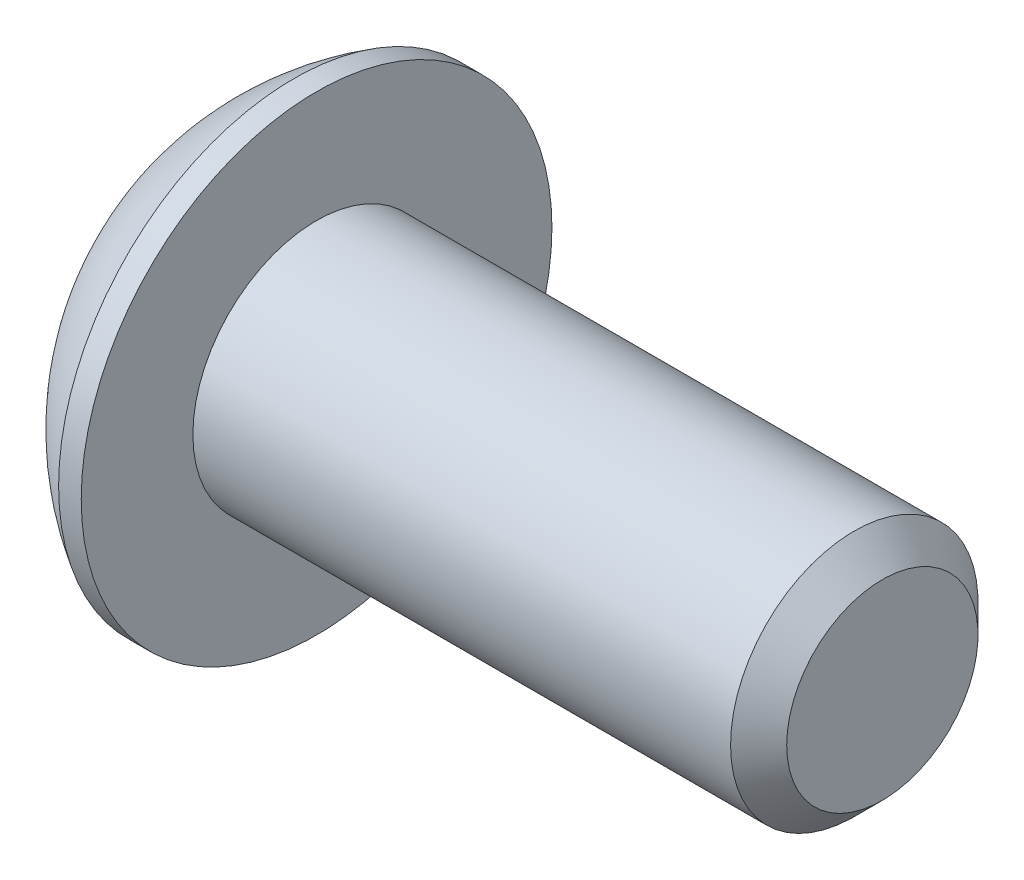
ISO-10303-21;
HEADER;
FILE_DESCRIPTION(('STEP AP214'),'2;1');
FILE_NAME('part.step','',(''),(''),'','','');
FILE_SCHEMA(('AUTOMOTIVE_DESIGN { 1 0 10303 214 1 1 1 1 }'));
ENDSEC;
DATA;
#1=APPLICATION_CONTEXT('core data for automotive mechanical design processes');
#2=APPLICATION_PROTOCOL_DEFINITION('international standard','automotive_design',2000,#1);
#3=PRODUCT_CONTEXT('',#1,'mechanical');
#4=PRODUCT('Part','Part','',(#3));
#5=PRODUCT_RELATED_PRODUCT_CATEGORY('part','',(#4));
#6=PRODUCT_DEFINITION_FORMATION('','',#4);
#7=PRODUCT_DEFINITION_CONTEXT('part definition',#1,'design');
#8=PRODUCT_DEFINITION('design','',#6,#7);
#9=PRODUCT_DEFINITION_SHAPE('','',#8);
#10=(LENGTH_UNIT() NAMED_UNIT(*) SI_UNIT(.MILLI.,.METRE.));
#11=(NAMED_UNIT(*) PLANE_ANGLE_UNIT() SI_UNIT($,.RADIAN.));
#12=(NAMED_UNIT(*) SI_UNIT($,.STERADIAN.) SOLID_ANGLE_UNIT());
#13=UNCERTAINTY_MEASURE_WITH_UNIT(LENGTH_MEASURE(1.E-05),#10,'distance_accuracy_value','');
#14=(GEOMETRIC_REPRESENTATION_CONTEXT(3) GLOBAL_UNCERTAINTY_ASSIGNED_CONTEXT((#13)) GLOBAL_UNIT_ASSIGNED_CONTEXT((#10,
#11,#12)) REPRESENTATION_CONTEXT('',''));
#15=CARTESIAN_POINT('',(0.,0.,0.));
#16=DIRECTION('',(0.,0.,1.));
#17=DIRECTION('',(1.,0.,0.));
#18=AXIS2_PLACEMENT_3D('',#15,#16,#17);
#19=CARTESIAN_POINT('',(1.32080000014412,0.,0.));
#20=DIRECTION('',(-1.,0.,0.));
#21=DIRECTION('',(0.,0.,1.));
#22=AXIS2_PLACEMENT_3D('',#19,#20,#21);
#23=CONICAL_SURFACE('',#22,1.1937999997258,1.04719755090695);
#24=CARTESIAN_POINT('',(2.01004075140077,0.,3.41060513164848E-10));
#25=VERTEX_POINT('',#24);
#26=VERTEX_LOOP('',#25);
#27=FACE_BOUND('',#26,.T.);
#28=CARTESIAN_POINT('',(1.32079999998002,0.,0.));
#29=DIRECTION('',(-1.,0.,0.));
#30=DIRECTION('',(0.,0.,1.));
#31=AXIS2_PLACEMENT_3D('',#28,#29,#30);
#32=CIRCLE('',#31,1.19380000001001);
#33=CARTESIAN_POINT('',(1.32079999999001,-1.03386112704374,0.596900000002159));
#34=VERTEX_POINT('',#33);
#35=CARTESIAN_POINT('',(1.32079999999762,0.,1.1937999999933));
#36=VERTEX_POINT('',#35);
#37=EDGE_CURVE('E92',#34,#36,#32,.T.);
#38=ORIENTED_EDGE('',*,*,#37,.T.);
#39=CARTESIAN_POINT('',(1.32079999998002,0.,0.));
#40=DIRECTION('',(-1.,0.,0.));
#41=DIRECTION('',(0.,0.,1.));
#42=AXIS2_PLACEMENT_3D('',#39,#40,#41);
#43=CIRCLE('',#42,1.19380000001001);
#44=CARTESIAN_POINT('',(1.32079999999001,1.0338611271453,0.596899999814944));
#45=VERTEX_POINT('',#44);
#46=EDGE_CURVE('E88',#36,#45,#43,.T.);
#47=ORIENTED_EDGE('',*,*,#46,.T.);
#48=CARTESIAN_POINT('',(1.32079999998003,0.,0.));
#49=DIRECTION('',(-1.,0.,0.));
#50=DIRECTION('',(0.,0.,1.));
#51=AXIS2_PLACEMENT_3D('',#48,#49,#50);
#52=CIRCLE('',#51,1.19380000001001);
#53=CARTESIAN_POINT('',(1.32079999999001,1.03386112693203,-0.596900000187939));
#54=VERTEX_POINT('',#53);
#55=EDGE_CURVE('E21',#45,#54,#52,.T.);
#56=ORIENTED_EDGE('',*,*,#55,.T.);
#57=CARTESIAN_POINT('',(1.32079999998002,0.,0.));
#58=DIRECTION('',(-1.,0.,0.));
#59=DIRECTION('',(0.,0.,1.));
#60=AXIS2_PLACEMENT_3D('',#57,#58,#59);
#61=CIRCLE('',#60,1.19380000001001);
#62=CARTESIAN_POINT('',(1.32079999999762,0.,-1.1937999999933));
#63=VERTEX_POINT('',#62);
#64=EDGE_CURVE('E151',#54,#63,#61,.T.);
#65=ORIENTED_EDGE('',*,*,#64,.T.);
#66=CARTESIAN_POINT('',(1.32079999998002,0.,0.));
#67=DIRECTION('',(-1.,0.,0.));
#68=DIRECTION('',(0.,0.,1.));
#69=AXIS2_PLACEMENT_3D('',#66,#67,#68);
#70=CIRCLE('',#69,1.19380000001001);
#71=CARTESIAN_POINT('',(1.32079999999001,-1.03386112704296,-0.596900000001708));
#72=VERTEX_POINT('',#71);
#73=EDGE_CURVE('E153',#63,#72,#70,.T.);
#74=ORIENTED_EDGE('',*,*,#73,.T.);
#75=CARTESIAN_POINT('',(1.32079999998002,0.,0.));
#76=DIRECTION('',(-1.,0.,0.));
#77=DIRECTION('',(0.,0.,1.));
#78=AXIS2_PLACEMENT_3D('',#75,#76,#77);
#79=CIRCLE('',#78,1.19380000001001);
#80=EDGE_CURVE('E155',#72,#34,#79,.T.);
#81=ORIENTED_EDGE('',*,*,#80,.T.);
#82=EDGE_LOOP('',(#38,#47,#56,#65,#74,#81));
#83=FACE_BOUND('',#82,.T.);
#84=ADVANCED_FACE('F17',(#27,#83),#23,.F.);
#85=CARTESIAN_POINT('',(1.3208,-2.06772225408,-1.1938));
#86=DIRECTION('',(1.,0.,0.));
#87=DIRECTION('',(0.,0.,-1.));
#88=AXIS2_PLACEMENT_3D('',#85,#86,#87);
#89=PLANE('',#88);
#90=DIRECTION('',(0.,-0.50000000000019,-0.866025403784329));
#91=VECTOR('',#90,1.);
#92=CARTESIAN_POINT('',(1.3208,1.37848150272,0.));
#93=LINE('',#92,#91);
#94=CARTESIAN_POINT('',(1.3208,1.37848150279077,-3.72749622214019E-10));
#95=VERTEX_POINT('',#94);
#96=EDGE_CURVE('E104',#54,#95,#93,.F.);
#97=ORIENTED_EDGE('',*,*,#96,.F.);
#98=ORIENTED_EDGE('',*,*,#55,.F.);
#99=DIRECTION('',(0.,0.50000000000019,-0.866025403784329));
#100=VECTOR('',#99,1.);
#101=CARTESIAN_POINT('',(1.3208,0.689240751359,1.1938));
#102=LINE('',#101,#100);
#103=EDGE_CURVE('E102',#95,#45,#102,.F.);
#104=ORIENTED_EDGE('',*,*,#103,.F.);
#105=EDGE_LOOP('',(#97,#98,#104));
#106=FACE_BOUND('',#105,.T.);
#107=ADVANCED_FACE('F100',(#106),#89,.F.);
#108=CARTESIAN_POINT('',(1.3208,-2.06772225408,-1.1938));
#109=DIRECTION('',(1.,0.,0.));
#110=DIRECTION('',(0.,0.,-1.));
#111=AXIS2_PLACEMENT_3D('',#108,#109,#110);
#112=PLANE('',#111);
#113=DIRECTION('',(0.,0.50000000000019,-0.866025403784329));
#114=VECTOR('',#113,1.);
#115=CARTESIAN_POINT('',(1.3208,0.689240751359,1.1938));
#116=LINE('',#115,#114);
#117=CARTESIAN_POINT('',(1.3208,0.689240751645,1.1938));
#118=VERTEX_POINT('',#117);
#119=EDGE_CURVE('E106',#45,#118,#116,.F.);
#120=ORIENTED_EDGE('',*,*,#119,.F.);
#121=ORIENTED_EDGE('',*,*,#46,.F.);
#122=DIRECTION('',(0.,1.,0.));
#123=VECTOR('',#122,1.);
#124=CARTESIAN_POINT('',(1.3208,-0.689240751359,1.1938));
#125=LINE('',#124,#123);
#126=EDGE_CURVE('E109',#118,#36,#125,.F.);
#127=ORIENTED_EDGE('',*,*,#126,.F.);
#128=EDGE_LOOP('',(#120,#121,#127));
#129=FACE_BOUND('',#128,.T.);
#130=ADVANCED_FACE('F107',(#129),#112,.F.);
#131=CARTESIAN_POINT('',(1.3208,-2.06772225408,-1.1938));
#132=DIRECTION('',(1.,0.,0.));
#133=DIRECTION('',(0.,0.,-1.));
#134=AXIS2_PLACEMENT_3D('',#131,#132,#133);
#135=PLANE('',#134);
#136=DIRECTION('',(0.,1.,0.));
#137=VECTOR('',#136,1.);
#138=CARTESIAN_POINT('',(1.3208,-0.689240751359,1.1938));
#139=LINE('',#138,#137);
#140=CARTESIAN_POINT('',(1.3208,-0.689240751152531,1.19380000011176));
#141=VERTEX_POINT('',#140);
#142=EDGE_CURVE('E169',#36,#141,#139,.F.);
#143=ORIENTED_EDGE('',*,*,#142,.F.);
#144=ORIENTED_EDGE('',*,*,#37,.F.);
#145=DIRECTION('',(0.,0.50000000000019,0.866025403784329));
#146=VECTOR('',#145,1.);
#147=CARTESIAN_POINT('',(1.3208,-1.37848150272,0.));
#148=LINE('',#147,#146);
#149=EDGE_CURVE('E167',#141,#34,#148,.F.);
#150=ORIENTED_EDGE('',*,*,#149,.F.);
#151=EDGE_LOOP('',(#143,#144,#150));
#152=FACE_BOUND('',#151,.T.);
#153=ADVANCED_FACE('F165',(#152),#135,.F.);
#154=CARTESIAN_POINT('',(1.3208,-2.06772225408,-1.1938));
#155=DIRECTION('',(1.,0.,0.));
#156=DIRECTION('',(0.,0.,-1.));
#157=AXIS2_PLACEMENT_3D('',#154,#155,#156);
#158=PLANE('',#157);
#159=DIRECTION('',(0.,0.50000000000019,0.866025403784329));
#160=VECTOR('',#159,1.);
#161=CARTESIAN_POINT('',(1.3208,-1.37848150272,0.));
#162=LINE('',#161,#160);
#163=CARTESIAN_POINT('',(1.3208,-1.37848150279077,3.72752211722761E-10));
#164=VERTEX_POINT('',#163);
#165=EDGE_CURVE('E170',#34,#164,#162,.F.);
#166=ORIENTED_EDGE('',*,*,#165,.F.);
#167=ORIENTED_EDGE('',*,*,#80,.F.);
#168=DIRECTION('',(0.,-0.50000000000019,0.866025403784329));
#169=VECTOR('',#168,1.);
#170=CARTESIAN_POINT('',(1.3208,-0.689240751359,-1.1938));
#171=LINE('',#170,#169);
#172=EDGE_CURVE('E173',#164,#72,#171,.F.);
#173=ORIENTED_EDGE('',*,*,#172,.F.);
#174=EDGE_LOOP('',(#166,#167,#173));
#175=FACE_BOUND('',#174,.T.);
#176=ADVANCED_FACE('F171',(#175),#158,.F.);
#177=CARTESIAN_POINT('',(1.3208,-2.06772225408,-1.1938));
#178=DIRECTION('',(1.,0.,0.));
#179=DIRECTION('',(0.,0.,-1.));
#180=AXIS2_PLACEMENT_3D('',#177,#178,#179);
#181=PLANE('',#180);
#182=DIRECTION('',(0.,-0.50000000000019,0.866025403784329));
#183=VECTOR('',#182,1.);
#184=CARTESIAN_POINT('',(1.3208,-0.689240751359,-1.1938));
#185=LINE('',#184,#183);
#186=CARTESIAN_POINT('',(1.3208,-0.6892407517165,-1.19379999987616));
#187=VERTEX_POINT('',#186);
#188=EDGE_CURVE('E229',#72,#187,#185,.F.);
#189=ORIENTED_EDGE('',*,*,#188,.F.);
#190=ORIENTED_EDGE('',*,*,#73,.F.);
#191=DIRECTION('',(0.,1.,0.));
#192=VECTOR('',#191,1.);
#193=CARTESIAN_POINT('',(1.3208,0.689240751359,-1.1938));
#194=LINE('',#193,#192);
#195=EDGE_CURVE('E241',#187,#63,#194,.T.);
#196=ORIENTED_EDGE('',*,*,#195,.F.);
#197=EDGE_LOOP('',(#189,#190,#196));
#198=FACE_BOUND('',#197,.T.);
#199=ADVANCED_FACE('F390',(#198),#181,.F.);
#200=CARTESIAN_POINT('',(1.3208,-2.06772225408,-1.1938));
#201=DIRECTION('',(1.,0.,0.));
#202=DIRECTION('',(0.,0.,-1.));
#203=AXIS2_PLACEMENT_3D('',#200,#201,#202);
#204=PLANE('',#203);
#205=DIRECTION('',(0.,1.,0.));
#206=VECTOR('',#205,1.);
#207=CARTESIAN_POINT('',(1.3208,0.689240751359,-1.1938));
#208=LINE('',#207,#206);
#209=CARTESIAN_POINT('',(1.3208,0.689240751117686,-1.19380000001943));
#210=VERTEX_POINT('',#209);
#211=EDGE_CURVE('E249',#63,#210,#208,.T.);
#212=ORIENTED_EDGE('',*,*,#211,.F.);
#213=ORIENTED_EDGE('',*,*,#64,.F.);
#214=DIRECTION('',(0.,-0.50000000000019,-0.866025403784329));
#215=VECTOR('',#214,1.);
#216=CARTESIAN_POINT('',(1.3208,1.37848150272,0.));
#217=LINE('',#216,#215);
#218=EDGE_CURVE('E128',#210,#54,#217,.F.);
#219=ORIENTED_EDGE('',*,*,#218,.F.);
#220=EDGE_LOOP('',(#212,#213,#219));
#221=FACE_BOUND('',#220,.T.);
#222=ADVANCED_FACE('F380',(#221),#204,.F.);
#223=CARTESIAN_POINT('',(1.3208,1.37848150272,0.));
#224=DIRECTION('',(0.,-0.866025403784329,0.50000000000019));
#225=DIRECTION('',(0.,-0.50000000000019,-0.866025403784329));
#226=AXIS2_PLACEMENT_3D('',#223,#224,#225);
#227=PLANE('',#226);
#228=ORIENTED_EDGE('',*,*,#96,.T.);
#229=DIRECTION('',(1.,0.,0.));
#230=VECTOR('',#229,1.);
#231=CARTESIAN_POINT('',(1.3208,1.37848150293344,-3.73289723784587E-10));
#232=LINE('',#231,#230);
#233=CARTESIAN_POINT('',(0.,1.37848150322979,-1.40005375444813E-10));
#234=VERTEX_POINT('',#233);
#235=EDGE_CURVE('E116',#234,#95,#232,.T.);
#236=ORIENTED_EDGE('',*,*,#235,.F.);
#237=DIRECTION('',(0.,0.500000000088179,0.866025403733529));
#238=VECTOR('',#237,1.);
#239=CARTESIAN_POINT('',(0.,0.689240751788,-1.19380000047));
#240=LINE('',#239,#238);
#241=CARTESIAN_POINT('',(0.,0.689240751311394,-1.19380000020132));
#242=VERTEX_POINT('',#241);
#243=EDGE_CURVE('E131',#242,#234,#240,.T.);
#244=ORIENTED_EDGE('',*,*,#243,.F.);
#245=DIRECTION('',(1.,0.,0.));
#246=VECTOR('',#245,1.);
#247=CARTESIAN_POINT('',(1.3208,0.689240750929,-1.1938));
#248=LINE('',#247,#246);
#249=EDGE_CURVE('E135',#210,#242,#248,.F.);
#250=ORIENTED_EDGE('',*,*,#249,.F.);
#251=ORIENTED_EDGE('',*,*,#218,.T.);
#252=EDGE_LOOP('',(#228,#236,#244,#250,#251));
#253=FACE_BOUND('',#252,.T.);
#254=ADVANCED_FACE('F371',(#253),#227,.T.);
#255=CARTESIAN_POINT('',(1.3208,0.689240751359,1.1938));
#256=DIRECTION('',(0.,-0.866025403784329,-0.50000000000019));
#257=DIRECTION('',(0.,0.50000000000019,-0.866025403784329));
#258=AXIS2_PLACEMENT_3D('',#255,#256,#257);
#259=PLANE('',#258);
#260=ORIENTED_EDGE('',*,*,#119,.T.);
#261=DIRECTION('',(1.,0.,0.));
#262=VECTOR('',#261,1.);
#263=CARTESIAN_POINT('',(1.3208,0.689240751788,1.1938));
#264=LINE('',#263,#262);
#265=CARTESIAN_POINT('',(0.,0.68924075168075,1.193800000235));
#266=VERTEX_POINT('',#265);
#267=EDGE_CURVE('E112',#266,#118,#264,.T.);
#268=ORIENTED_EDGE('',*,*,#267,.F.);
#269=DIRECTION('',(0.,-0.500000000088179,0.866025403733529));
#270=VECTOR('',#269,1.);
#271=CARTESIAN_POINT('',(0.,1.37848150358,0.));
#272=LINE('',#271,#270);
#273=EDGE_CURVE('E134',#234,#266,#272,.T.);
#274=ORIENTED_EDGE('',*,*,#273,.F.);
#275=ORIENTED_EDGE('',*,*,#235,.T.);
#276=ORIENTED_EDGE('',*,*,#103,.T.);
#277=EDGE_LOOP('',(#260,#268,#274,#275,#276));
#278=FACE_BOUND('',#277,.T.);
#279=ADVANCED_FACE('F114',(#278),#259,.T.);
#280=CARTESIAN_POINT('',(1.3208,-0.689240751359,1.1938));
#281=DIRECTION('',(0.,0.,-1.));
#282=DIRECTION('',(0.,1.,0.));
#283=AXIS2_PLACEMENT_3D('',#280,#281,#282);
#284=PLANE('',#283);
#285=ORIENTED_EDGE('',*,*,#142,.T.);
#286=DIRECTION('',(1.,0.,0.));
#287=VECTOR('',#286,1.);
#288=CARTESIAN_POINT('',(1.3208,-0.689240751264297,1.19380000016764));
#289=LINE('',#288,#287);
#290=CARTESIAN_POINT('',(0.,-0.68924075152334,1.19380000032368));
#291=VERTEX_POINT('',#290);
#292=EDGE_CURVE('E180',#291,#141,#289,.T.);
#293=ORIENTED_EDGE('',*,*,#292,.F.);
#294=DIRECTION('',(0.,1.,0.));
#295=VECTOR('',#294,1.);
#296=CARTESIAN_POINT('',(0.,0.,1.19380000047));
#297=LINE('',#296,#295);
#298=EDGE_CURVE('E194',#266,#291,#297,.F.);
#299=ORIENTED_EDGE('',*,*,#298,.F.);
#300=ORIENTED_EDGE('',*,*,#267,.T.);
#301=ORIENTED_EDGE('',*,*,#126,.T.);
#302=EDGE_LOOP('',(#285,#293,#299,#300,#301));
#303=FACE_BOUND('',#302,.T.);
#304=ADVANCED_FACE('F217',(#303),#284,.T.);
#305=CARTESIAN_POINT('',(1.3208,-1.37848150272,0.));
#306=DIRECTION('',(0.,0.866025403784329,-0.50000000000019));
#307=DIRECTION('',(0.,0.50000000000019,0.866025403784329));
#308=AXIS2_PLACEMENT_3D('',#305,#306,#307);
#309=PLANE('',#308);
#310=ORIENTED_EDGE('',*,*,#165,.T.);
#311=DIRECTION('',(1.,0.,0.));
#312=VECTOR('',#311,1.);
#313=CARTESIAN_POINT('',(1.3208,-1.37848150293344,3.73289723784587E-10));
#314=LINE('',#313,#312);
#315=CARTESIAN_POINT('',(0.,-1.3784815032298,1.40007636216698E-10));
#316=VERTEX_POINT('',#315);
#317=EDGE_CURVE('E176',#316,#164,#314,.T.);
#318=ORIENTED_EDGE('',*,*,#317,.F.);
#319=DIRECTION('',(0.,-0.500000000088179,-0.866025403733529));
#320=VECTOR('',#319,1.);
#321=CARTESIAN_POINT('',(0.,-0.689240751788,1.19380000047));
#322=LINE('',#321,#320);
#323=EDGE_CURVE('E197',#291,#316,#322,.T.);
#324=ORIENTED_EDGE('',*,*,#323,.F.);
#325=ORIENTED_EDGE('',*,*,#292,.T.);
#326=ORIENTED_EDGE('',*,*,#149,.T.);
#327=EDGE_LOOP('',(#310,#318,#324,#325,#326));
#328=FACE_BOUND('',#327,.T.);
#329=ADVANCED_FACE('F178',(#328),#309,.T.);
#330=CARTESIAN_POINT('',(1.3208,-0.689240751359,-1.1938));
#331=DIRECTION('',(0.,0.866025403784329,0.50000000000019));
#332=DIRECTION('',(0.,-0.50000000000019,0.866025403784329));
#333=AXIS2_PLACEMENT_3D('',#330,#331,#332);
#334=PLANE('',#333);
#335=ORIENTED_EDGE('',*,*,#188,.T.);
#336=DIRECTION('',(1.,0.,0.));
#337=VECTOR('',#336,1.);
#338=CARTESIAN_POINT('',(1.3208,-0.689240751788,-1.1938));
#339=LINE('',#338,#337);
#340=CARTESIAN_POINT('',(0.,-0.689240751788,-1.1938));
#341=VERTEX_POINT('',#340);
#342=EDGE_CURVE('E36',#341,#187,#339,.T.);
#343=ORIENTED_EDGE('',*,*,#342,.F.);
#344=DIRECTION('',(0.,0.500000000088179,-0.866025403733529));
#345=VECTOR('',#344,1.);
#346=CARTESIAN_POINT('',(0.,-1.37848150358,0.));
#347=LINE('',#346,#345);
#348=EDGE_CURVE('E218',#316,#341,#347,.T.);
#349=ORIENTED_EDGE('',*,*,#348,.F.);
#350=ORIENTED_EDGE('',*,*,#317,.T.);
#351=ORIENTED_EDGE('',*,*,#172,.T.);
#352=EDGE_LOOP('',(#335,#343,#349,#350,#351));
#353=FACE_BOUND('',#352,.T.);
#354=ADVANCED_FACE('F337',(#353),#334,.T.);
#355=CARTESIAN_POINT('',(1.3208,0.689240751359,-1.1938));
#356=DIRECTION('',(0.,0.,1.));
#357=DIRECTION('',(1.,0.,0.));
#358=AXIS2_PLACEMENT_3D('',#355,#356,#357);
#359=PLANE('',#358);
#360=ORIENTED_EDGE('',*,*,#211,.T.);
#361=ORIENTED_EDGE('',*,*,#249,.T.);
#362=DIRECTION('',(0.,1.,0.));
#363=VECTOR('',#362,1.);
#364=CARTESIAN_POINT('',(0.,0.,-1.19380000047));
#365=LINE('',#364,#363);
#366=EDGE_CURVE('E150',#341,#242,#365,.T.);
#367=ORIENTED_EDGE('',*,*,#366,.F.);
#368=ORIENTED_EDGE('',*,*,#342,.T.);
#369=ORIENTED_EDGE('',*,*,#195,.T.);
#370=EDGE_LOOP('',(#360,#361,#367,#368,#369));
#371=FACE_BOUND('',#370,.T.);
#372=ADVANCED_FACE('F329',(#371),#359,.T.);
#373=CARTESIAN_POINT('',(0.,0.,0.));
#374=DIRECTION('',(-1.,0.,0.));
#375=DIRECTION('',(0.,0.,1.));
#376=AXIS2_PLACEMENT_3D('',#373,#374,#375);
#377=PLANE('',#376);
#378=ORIENTED_EDGE('',*,*,#348,.T.);
#379=ORIENTED_EDGE('',*,*,#366,.T.);
#380=ORIENTED_EDGE('',*,*,#243,.T.);
#381=ORIENTED_EDGE('',*,*,#273,.T.);
#382=ORIENTED_EDGE('',*,*,#298,.T.);
#383=ORIENTED_EDGE('',*,*,#323,.T.);
#384=EDGE_LOOP('',(#378,#379,#380,#381,#382,#383));
#385=FACE_BOUND('',#384,.T.);
#386=CARTESIAN_POINT('',(0.,4.34201286036991E-12,-3.43540300365552E-12));
#387=DIRECTION('',(-1.,0.,0.));
#388=DIRECTION('',(0.,0.,1.));
#389=AXIS2_PLACEMENT_3D('',#386,#387,#388);
#390=CIRCLE('',#389,1.98120000000426);
#391=CARTESIAN_POINT('',(0.,4.34201286036991E-12,1.98120000000082));
#392=VERTEX_POINT('',#391);
#393=EDGE_CURVE('E147',#392,#392,#390,.F.);
#394=ORIENTED_EDGE('',*,*,#393,.F.);
#395=EDGE_LOOP('',(#394));
#396=FACE_BOUND('',#395,.T.);
#397=ADVANCED_FACE('F210',(#385,#396),#377,.T.);
#398=CARTESIAN_POINT('',(4.13384999999375,4.34201286036995E-12,-3.43540300373757E-12));
#399=DIRECTION('',(0.,1.,0.));
#400=DIRECTION('',(-0.489667403954283,0.,-0.871909303485559));
#401=AXIS2_PLACEMENT_3D('',#398,#399,#400);
#402=SPHERICAL_SURFACE('',#401,4.58408870578059);
#403=CARTESIAN_POINT('',(4.13384999999375,4.34201286036995E-12,-3.43540300373757E-12));
#404=DIRECTION('',(-1.,0.,0.));
#405=DIRECTION('',(0.,0.,1.));
#406=AXIS2_PLACEMENT_3D('',#403,#404,#405);
#407=SPHERICAL_SURFACE('',#406,4.58408870578059);
#408=ORIENTED_EDGE('',*,*,#393,.T.);
#409=EDGE_LOOP('',(#408));
#410=FACE_BOUND('',#409,.T.);
#411=CARTESIAN_POINT('',(1.82880000025,0.,0.));
#412=DIRECTION('',(-1.,0.,0.));
#413=DIRECTION('',(0.,0.,1.));
#414=AXIS2_PLACEMENT_3D('',#411,#412,#413);
#415=CIRCLE('',#414,3.9624);
#416=CARTESIAN_POINT('',(1.82880000025,0.,3.9624));
#417=VERTEX_POINT('',#416);
#418=EDGE_CURVE('E144',#417,#417,#415,.F.);
#419=ORIENTED_EDGE('',*,*,#418,.F.);
#420=EDGE_LOOP('',(#419));
#421=FACE_BOUND('',#420,.T.);
#422=ADVANCED_FACE('F19',(#410,#421),#407,.T.);
#423=CARTESIAN_POINT('',(11.7348,0.,0.));
#424=DIRECTION('',(-1.,0.,0.));
#425=DIRECTION('',(0.,0.,1.));
#426=AXIS2_PLACEMENT_3D('',#423,#424,#425);
#427=PLANE('',#426);
#428=CARTESIAN_POINT('',(11.7347999998856,0.,0.));
#429=DIRECTION('',(-1.,0.,0.));
#430=DIRECTION('',(0.,0.,1.));
#431=AXIS2_PLACEMENT_3D('',#428,#429,#430);
#432=CIRCLE('',#431,1.61036000002923);
#433=CARTESIAN_POINT('',(11.7347999998856,0.,1.61036000002923));
#434=VERTEX_POINT('',#433);
#435=EDGE_CURVE('E141',#434,#434,#432,.T.);
#436=ORIENTED_EDGE('',*,*,#435,.F.);
#437=EDGE_LOOP('',(#436));
#438=FACE_BOUND('',#437,.T.);
#439=ADVANCED_FACE('F271',(#438),#427,.F.);
#440=CARTESIAN_POINT('',(0.,0.,0.));
#441=DIRECTION('',(-1.,0.,0.));
#442=DIRECTION('',(0.,0.,1.));
#443=AXIS2_PLACEMENT_3D('',#440,#441,#442);
#444=CYLINDRICAL_SURFACE('',#443,3.9624);
#445=ORIENTED_EDGE('',*,*,#418,.T.);
#446=EDGE_LOOP('',(#445));
#447=FACE_BOUND('',#446,.T.);
#448=CARTESIAN_POINT('',(2.20979999937,0.,0.));
#449=DIRECTION('',(-1.,0.,0.));
#450=DIRECTION('',(0.,0.,1.));
#451=AXIS2_PLACEMENT_3D('',#448,#449,#450);
#452=CIRCLE('',#451,3.9624);
#453=CARTESIAN_POINT('',(2.20979999937,0.,3.9624));
#454=VERTEX_POINT('',#453);
#455=EDGE_CURVE('E138',#454,#454,#452,.T.);
#456=ORIENTED_EDGE('',*,*,#455,.T.);
#457=EDGE_LOOP('',(#456));
#458=FACE_BOUND('',#457,.T.);
#459=ADVANCED_FACE('F267',(#447,#458),#444,.T.);
#460=CARTESIAN_POINT('',(11.2623599995914,0.,0.));
#461=DIRECTION('',(-1.,0.,0.));
#462=DIRECTION('',(0.,0.,1.));
#463=AXIS2_PLACEMENT_3D('',#460,#461,#462);
#464=CONICAL_SURFACE('',#463,2.08280000032346,0.785398163397448);
#465=CARTESIAN_POINT('',(11.2623599991,0.,0.));
#466=DIRECTION('',(-1.,0.,0.));
#467=DIRECTION('',(0.,0.,1.));
#468=AXIS2_PLACEMENT_3D('',#465,#466,#467);
#469=CIRCLE('',#468,2.0828);
#470=CARTESIAN_POINT('',(11.2623599991,0.,2.0828));
#471=VERTEX_POINT('',#470);
#472=EDGE_CURVE('E27',#471,#471,#469,.T.);
#473=ORIENTED_EDGE('',*,*,#472,.F.);
#474=EDGE_LOOP('',(#473));
#475=FACE_BOUND('',#474,.T.);
#476=ORIENTED_EDGE('',*,*,#435,.T.);
#477=EDGE_LOOP('',(#476));
#478=FACE_BOUND('',#477,.T.);
#479=ADVANCED_FACE('F263',(#475,#478),#464,.T.);
#480=CARTESIAN_POINT('',(2.2098,2.0828,0.));
#481=DIRECTION('',(-1.,0.,0.));
#482=DIRECTION('',(0.,0.,1.));
#483=AXIS2_PLACEMENT_3D('',#480,#481,#482);
#484=PLANE('',#483);
#485=CARTESIAN_POINT('',(2.20979999937,0.,0.));
#486=DIRECTION('',(-1.,0.,0.));
#487=DIRECTION('',(0.,0.,1.));
#488=AXIS2_PLACEMENT_3D('',#485,#486,#487);
#489=CIRCLE('',#488,2.0828);
#490=CARTESIAN_POINT('',(2.20979999937,0.,2.0828));
#491=VERTEX_POINT('',#490);
#492=EDGE_CURVE('E11',#491,#491,#489,.F.);
#493=ORIENTED_EDGE('',*,*,#492,.F.);
#494=EDGE_LOOP('',(#493));
#495=FACE_BOUND('',#494,.T.);
#496=ORIENTED_EDGE('',*,*,#455,.F.);
#497=EDGE_LOOP('',(#496));
#498=FACE_BOUND('',#497,.T.);
#499=ADVANCED_FACE('F266',(#495,#498),#484,.F.);
#500=CARTESIAN_POINT('',(0.,0.,0.));
#501=DIRECTION('',(-1.,0.,0.));
#502=DIRECTION('',(0.,0.,1.));
#503=AXIS2_PLACEMENT_3D('',#500,#501,#502);
#504=CYLINDRICAL_SURFACE('',#503,2.0828);
#505=ORIENTED_EDGE('',*,*,#492,.T.);
#506=EDGE_LOOP('',(#505));
#507=FACE_BOUND('',#506,.T.);
#508=ORIENTED_EDGE('',*,*,#472,.T.);
#509=EDGE_LOOP('',(#508));
#510=FACE_BOUND('',#509,.T.);
#511=ADVANCED_FACE('F261',(#507,#510),#504,.T.);
#512=CLOSED_SHELL('',(#84,#107,#130,#153,#176,#199,#222,#254,#279,#304,#329,#354,#372,#397,#422,
#439,#459,#479,#499,#511));
#513=MANIFOLD_SOLID_BREP('B1',#512);
#514=ADVANCED_BREP_SHAPE_REPRESENTATION('',(#18,#513),#14);
#515=SHAPE_DEFINITION_REPRESENTATION(#9,#514);
ENDSEC;
END-ISO-10303-21;
